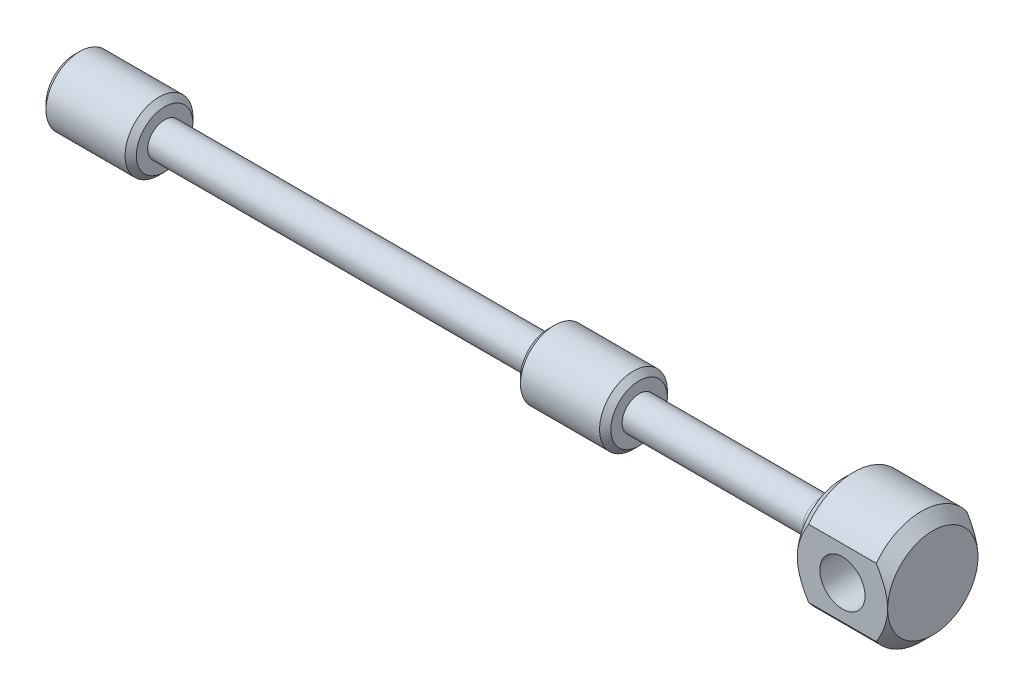
ISO-10303-21;
HEADER;
FILE_DESCRIPTION(('STEP AP214'),'2;1');
FILE_NAME('part.step','',(''),(''),'','','');
FILE_SCHEMA(('AUTOMOTIVE_DESIGN { 1 0 10303 214 1 1 1 1 }'));
ENDSEC;
DATA;
#1=APPLICATION_CONTEXT('core data for automotive mechanical design processes');
#2=APPLICATION_PROTOCOL_DEFINITION('international standard','automotive_design',2000,#1);
#3=PRODUCT_CONTEXT('',#1,'mechanical');
#4=PRODUCT('Part','Part','',(#3));
#5=PRODUCT_RELATED_PRODUCT_CATEGORY('part','',(#4));
#6=PRODUCT_DEFINITION_FORMATION('','',#4);
#7=PRODUCT_DEFINITION_CONTEXT('part definition',#1,'design');
#8=PRODUCT_DEFINITION('design','',#6,#7);
#9=PRODUCT_DEFINITION_SHAPE('','',#8);
#10=(LENGTH_UNIT() NAMED_UNIT(*) SI_UNIT(.MILLI.,.METRE.));
#11=(NAMED_UNIT(*) PLANE_ANGLE_UNIT() SI_UNIT($,.RADIAN.));
#12=(NAMED_UNIT(*) SI_UNIT($,.STERADIAN.) SOLID_ANGLE_UNIT());
#13=UNCERTAINTY_MEASURE_WITH_UNIT(LENGTH_MEASURE(1.E-05),#10,'distance_accuracy_value','');
#14=(GEOMETRIC_REPRESENTATION_CONTEXT(3) GLOBAL_UNCERTAINTY_ASSIGNED_CONTEXT((#13)) GLOBAL_UNIT_ASSIGNED_CONTEXT((#10,
#11,#12)) REPRESENTATION_CONTEXT('',''));
#15=CARTESIAN_POINT('',(0.,0.,0.));
#16=DIRECTION('',(0.,0.,1.));
#17=DIRECTION('',(1.,0.,0.));
#18=AXIS2_PLACEMENT_3D('',#15,#16,#17);
#19=CARTESIAN_POINT('',(30.,0.,0.));
#20=DIRECTION('',(1.,0.,0.));
#21=DIRECTION('',(0.,0.,-1.));
#22=AXIS2_PLACEMENT_3D('',#19,#20,#21);
#23=CYLINDRICAL_SURFACE('',#22,5.);
#24=DIRECTION('',(1.,0.,0.));
#25=VECTOR('',#24,1.);
#26=CARTESIAN_POINT('',(30.,3.,-4.));
#27=LINE('',#26,#25);
#28=CARTESIAN_POINT('',(31.,3.,-4.));
#29=VERTEX_POINT('',#28);
#30=CARTESIAN_POINT('',(37.,3.,-4.));
#31=VERTEX_POINT('',#30);
#32=EDGE_CURVE('E322',#29,#31,#27,.T.);
#33=ORIENTED_EDGE('',*,*,#32,.F.);
#34=CARTESIAN_POINT('',(31.,0.,0.));
#35=DIRECTION('',(1.,0.,0.));
#36=DIRECTION('',(0.,0.,-1.));
#37=AXIS2_PLACEMENT_3D('',#34,#35,#36);
#38=CIRCLE('',#37,5.);
#39=CARTESIAN_POINT('',(31.,3.,4.));
#40=VERTEX_POINT('',#39);
#41=EDGE_CURVE('E186',#29,#40,#38,.T.);
#42=ORIENTED_EDGE('',*,*,#41,.T.);
#43=DIRECTION('',(1.,0.,0.));
#44=VECTOR('',#43,1.);
#45=CARTESIAN_POINT('',(30.,3.,4.));
#46=LINE('',#45,#44);
#47=CARTESIAN_POINT('',(37.,3.,4.));
#48=VERTEX_POINT('',#47);
#49=EDGE_CURVE('E107',#40,#48,#46,.T.);
#50=ORIENTED_EDGE('',*,*,#49,.T.);
#51=CARTESIAN_POINT('',(37.,0.,0.));
#52=DIRECTION('',(1.,0.,0.));
#53=DIRECTION('',(0.,0.,-1.));
#54=AXIS2_PLACEMENT_3D('',#51,#52,#53);
#55=CIRCLE('',#54,5.);
#56=EDGE_CURVE('E97',#48,#31,#55,.F.);
#57=ORIENTED_EDGE('',*,*,#56,.T.);
#58=EDGE_LOOP('',(#33,#42,#50,#57));
#59=FACE_BOUND('',#58,.T.);
#60=ADVANCED_FACE('F34',(#59),#23,.T.);
#61=CARTESIAN_POINT('',(38.,0.,0.));
#62=DIRECTION('',(-1.,0.,0.));
#63=DIRECTION('',(0.,0.,1.));
#64=AXIS2_PLACEMENT_3D('',#61,#62,#63);
#65=CYLINDRICAL_SURFACE('',#64,1.5);
#66=CARTESIAN_POINT('',(28.,0.,0.));
#67=DIRECTION('',(1.,0.,0.));
#68=DIRECTION('',(0.,0.,-1.));
#69=AXIS2_PLACEMENT_3D('',#66,#67,#68);
#70=CIRCLE('',#69,1.5);
#71=CARTESIAN_POINT('',(28.,0.,-1.5));
#72=VERTEX_POINT('',#71);
#73=EDGE_CURVE('E11',#72,#72,#70,.F.);
#74=ORIENTED_EDGE('',*,*,#73,.T.);
#75=EDGE_LOOP('',(#74));
#76=FACE_BOUND('',#75,.T.);
#77=CARTESIAN_POINT('',(12.,0.,0.));
#78=DIRECTION('',(-1.,0.,0.));
#79=DIRECTION('',(0.,0.,1.));
#80=AXIS2_PLACEMENT_3D('',#77,#78,#79);
#81=CIRCLE('',#80,1.5);
#82=CARTESIAN_POINT('',(12.,0.,1.5));
#83=VERTEX_POINT('',#82);
#84=EDGE_CURVE('E279',#83,#83,#81,.T.);
#85=ORIENTED_EDGE('',*,*,#84,.F.);
#86=EDGE_LOOP('',(#85));
#87=FACE_BOUND('',#86,.T.);
#88=ADVANCED_FACE('F206',(#76,#87),#65,.T.);
#89=CARTESIAN_POINT('',(4.,0.,0.));
#90=DIRECTION('',(-1.,0.,0.));
#91=DIRECTION('',(0.,0.,1.));
#92=AXIS2_PLACEMENT_3D('',#89,#90,#91);
#93=CIRCLE('',#92,1.5);
#94=CARTESIAN_POINT('',(4.,0.,1.5));
#95=VERTEX_POINT('',#94);
#96=EDGE_CURVE('E275',#95,#95,#93,.T.);
#97=ORIENTED_EDGE('',*,*,#96,.T.);
#98=EDGE_LOOP('',(#97));
#99=FACE_BOUND('',#98,.T.);
#100=CARTESIAN_POINT('',(-30.,0.,0.));
#101=DIRECTION('',(-1.,0.,0.));
#102=DIRECTION('',(0.,0.,1.));
#103=AXIS2_PLACEMENT_3D('',#100,#101,#102);
#104=CIRCLE('',#103,1.5);
#105=CARTESIAN_POINT('',(-30.,0.,1.5));
#106=VERTEX_POINT('',#105);
#107=EDGE_CURVE('E276',#106,#106,#104,.T.);
#108=ORIENTED_EDGE('',*,*,#107,.F.);
#109=EDGE_LOOP('',(#108));
#110=FACE_BOUND('',#109,.T.);
#111=ADVANCED_FACE('F211',(#99,#110),#65,.T.);
#112=CARTESIAN_POINT('',(-30.,0.,0.));
#113=DIRECTION('',(-1.,0.,0.));
#114=DIRECTION('',(0.,0.,1.));
#115=AXIS2_PLACEMENT_3D('',#112,#113,#114);
#116=CYLINDRICAL_SURFACE('',#115,3.);
#117=CARTESIAN_POINT('',(-37.5,0.,0.));
#118=DIRECTION('',(1.,0.,0.));
#119=DIRECTION('',(0.,0.,-1.));
#120=AXIS2_PLACEMENT_3D('',#117,#118,#119);
#121=CIRCLE('',#120,3.);
#122=CARTESIAN_POINT('',(-37.5,0.,-3.));
#123=VERTEX_POINT('',#122);
#124=EDGE_CURVE('E300',#123,#123,#121,.T.);
#125=ORIENTED_EDGE('',*,*,#124,.T.);
#126=EDGE_LOOP('',(#125));
#127=FACE_BOUND('',#126,.T.);
#128=CARTESIAN_POINT('',(-30.5,0.,0.));
#129=DIRECTION('',(-1.,0.,0.));
#130=DIRECTION('',(0.,0.,1.));
#131=AXIS2_PLACEMENT_3D('',#128,#129,#130);
#132=CIRCLE('',#131,3.);
#133=CARTESIAN_POINT('',(-30.5,0.,3.));
#134=VERTEX_POINT('',#133);
#135=EDGE_CURVE('E297',#134,#134,#132,.T.);
#136=ORIENTED_EDGE('',*,*,#135,.T.);
#137=EDGE_LOOP('',(#136));
#138=FACE_BOUND('',#137,.T.);
#139=ADVANCED_FACE('F242',(#127,#138),#116,.T.);
#140=CARTESIAN_POINT('',(-30.,0.,0.));
#141=DIRECTION('',(-1.,0.,0.));
#142=DIRECTION('',(0.,0.,1.));
#143=AXIS2_PLACEMENT_3D('',#140,#141,#142);
#144=PLANE('',#143);
#145=CARTESIAN_POINT('',(-30.,0.,0.));
#146=DIRECTION('',(-1.,0.,0.));
#147=DIRECTION('',(0.,0.,1.));
#148=AXIS2_PLACEMENT_3D('',#145,#146,#147);
#149=CIRCLE('',#148,2.5);
#150=CARTESIAN_POINT('',(-30.,0.,2.5));
#151=VERTEX_POINT('',#150);
#152=EDGE_CURVE('E117',#151,#151,#149,.F.);
#153=ORIENTED_EDGE('',*,*,#152,.T.);
#154=EDGE_LOOP('',(#153));
#155=FACE_BOUND('',#154,.T.);
#156=ORIENTED_EDGE('',*,*,#107,.T.);
#157=EDGE_LOOP('',(#156));
#158=FACE_BOUND('',#157,.T.);
#159=ADVANCED_FACE('F248',(#155,#158),#144,.F.);
#160=CARTESIAN_POINT('',(-38.,0.,0.));
#161=DIRECTION('',(1.,0.,0.));
#162=DIRECTION('',(0.,0.,-1.));
#163=AXIS2_PLACEMENT_3D('',#160,#161,#162);
#164=PLANE('',#163);
#165=CARTESIAN_POINT('',(-38.,0.,0.));
#166=DIRECTION('',(1.,0.,0.));
#167=DIRECTION('',(0.,0.,-1.));
#168=AXIS2_PLACEMENT_3D('',#165,#166,#167);
#169=CIRCLE('',#168,2.5);
#170=CARTESIAN_POINT('',(-38.,0.,-2.5));
#171=VERTEX_POINT('',#170);
#172=EDGE_CURVE('E294',#171,#171,#169,.F.);
#173=ORIENTED_EDGE('',*,*,#172,.T.);
#174=EDGE_LOOP('',(#173));
#175=FACE_BOUND('',#174,.T.);
#176=ADVANCED_FACE('F244',(#175),#164,.F.);
#177=CARTESIAN_POINT('',(4.,0.,0.));
#178=DIRECTION('',(1.,0.,0.));
#179=DIRECTION('',(0.,0.,-1.));
#180=AXIS2_PLACEMENT_3D('',#177,#178,#179);
#181=CYLINDRICAL_SURFACE('',#180,3.);
#182=CARTESIAN_POINT('',(11.5,0.,0.));
#183=DIRECTION('',(-1.,0.,0.));
#184=DIRECTION('',(0.,0.,1.));
#185=AXIS2_PLACEMENT_3D('',#182,#183,#184);
#186=CIRCLE('',#185,3.);
#187=CARTESIAN_POINT('',(11.5,0.,3.));
#188=VERTEX_POINT('',#187);
#189=EDGE_CURVE('E287',#188,#188,#186,.T.);
#190=ORIENTED_EDGE('',*,*,#189,.T.);
#191=EDGE_LOOP('',(#190));
#192=FACE_BOUND('',#191,.T.);
#193=CARTESIAN_POINT('',(4.50000000000001,0.,0.));
#194=DIRECTION('',(-1.,0.,0.));
#195=DIRECTION('',(0.,0.,1.));
#196=AXIS2_PLACEMENT_3D('',#193,#194,#195);
#197=CIRCLE('',#196,3.);
#198=CARTESIAN_POINT('',(4.50000000000001,0.,3.));
#199=VERTEX_POINT('',#198);
#200=EDGE_CURVE('E284',#199,#199,#197,.F.);
#201=ORIENTED_EDGE('',*,*,#200,.T.);
#202=EDGE_LOOP('',(#201));
#203=FACE_BOUND('',#202,.T.);
#204=ADVANCED_FACE('F247',(#192,#203),#181,.T.);
#205=CARTESIAN_POINT('',(4.,0.,0.));
#206=DIRECTION('',(-1.,0.,0.));
#207=DIRECTION('',(0.,0.,1.));
#208=AXIS2_PLACEMENT_3D('',#205,#206,#207);
#209=PLANE('',#208);
#210=CARTESIAN_POINT('',(4.,0.,0.));
#211=DIRECTION('',(-1.,0.,0.));
#212=DIRECTION('',(0.,0.,1.));
#213=AXIS2_PLACEMENT_3D('',#210,#211,#212);
#214=CIRCLE('',#213,2.5);
#215=CARTESIAN_POINT('',(4.,0.,2.5));
#216=VERTEX_POINT('',#215);
#217=EDGE_CURVE('E272',#216,#216,#214,.T.);
#218=ORIENTED_EDGE('',*,*,#217,.T.);
#219=EDGE_LOOP('',(#218));
#220=FACE_BOUND('',#219,.T.);
#221=ORIENTED_EDGE('',*,*,#96,.F.);
#222=EDGE_LOOP('',(#221));
#223=FACE_BOUND('',#222,.T.);
#224=ADVANCED_FACE('F261',(#220,#223),#209,.T.);
#225=CARTESIAN_POINT('',(12.,0.,0.));
#226=DIRECTION('',(-1.,0.,0.));
#227=DIRECTION('',(0.,0.,1.));
#228=AXIS2_PLACEMENT_3D('',#225,#226,#227);
#229=PLANE('',#228);
#230=CARTESIAN_POINT('',(12.,0.,0.));
#231=DIRECTION('',(-1.,0.,0.));
#232=DIRECTION('',(0.,0.,1.));
#233=AXIS2_PLACEMENT_3D('',#230,#231,#232);
#234=CIRCLE('',#233,2.50000000000001);
#235=CARTESIAN_POINT('',(12.,0.,2.50000000000001));
#236=VERTEX_POINT('',#235);
#237=EDGE_CURVE('E290',#236,#236,#234,.F.);
#238=ORIENTED_EDGE('',*,*,#237,.T.);
#239=EDGE_LOOP('',(#238));
#240=FACE_BOUND('',#239,.T.);
#241=ORIENTED_EDGE('',*,*,#84,.T.);
#242=EDGE_LOOP('',(#241));
#243=FACE_BOUND('',#242,.T.);
#244=ADVANCED_FACE('F238',(#240,#243),#229,.F.);
#245=CARTESIAN_POINT('',(11.5,0.,0.));
#246=DIRECTION('',(-1.,0.,0.));
#247=DIRECTION('',(0.,0.,1.));
#248=AXIS2_PLACEMENT_3D('',#245,#246,#247);
#249=CONICAL_SURFACE('',#248,3.,0.785398163397453);
#250=ORIENTED_EDGE('',*,*,#237,.F.);
#251=EDGE_LOOP('',(#250));
#252=FACE_BOUND('',#251,.T.);
#253=ORIENTED_EDGE('',*,*,#189,.F.);
#254=EDGE_LOOP('',(#253));
#255=FACE_BOUND('',#254,.T.);
#256=ADVANCED_FACE('F235',(#252,#255),#249,.T.);
#257=CARTESIAN_POINT('',(4.,0.,0.));
#258=DIRECTION('',(1.,0.,0.));
#259=DIRECTION('',(0.,0.,-1.));
#260=AXIS2_PLACEMENT_3D('',#257,#258,#259);
#261=CONICAL_SURFACE('',#260,2.5,0.785398163397444);
#262=ORIENTED_EDGE('',*,*,#200,.F.);
#263=EDGE_LOOP('',(#262));
#264=FACE_BOUND('',#263,.T.);
#265=ORIENTED_EDGE('',*,*,#217,.F.);
#266=EDGE_LOOP('',(#265));
#267=FACE_BOUND('',#266,.T.);
#268=ADVANCED_FACE('F227',(#264,#267),#261,.T.);
#269=CARTESIAN_POINT('',(-38.,0.,0.));
#270=DIRECTION('',(1.,0.,0.));
#271=DIRECTION('',(0.,0.,-1.));
#272=AXIS2_PLACEMENT_3D('',#269,#270,#271);
#273=CONICAL_SURFACE('',#272,2.5,0.785398163397446);
#274=ORIENTED_EDGE('',*,*,#124,.F.);
#275=EDGE_LOOP('',(#274));
#276=FACE_BOUND('',#275,.T.);
#277=ORIENTED_EDGE('',*,*,#172,.F.);
#278=EDGE_LOOP('',(#277));
#279=FACE_BOUND('',#278,.T.);
#280=ADVANCED_FACE('F222',(#276,#279),#273,.T.);
#281=CARTESIAN_POINT('',(-30.5,0.,0.));
#282=DIRECTION('',(-1.,0.,0.));
#283=DIRECTION('',(0.,0.,1.));
#284=AXIS2_PLACEMENT_3D('',#281,#282,#283);
#285=CONICAL_SURFACE('',#284,3.,0.785398163397453);
#286=ORIENTED_EDGE('',*,*,#152,.F.);
#287=EDGE_LOOP('',(#286));
#288=FACE_BOUND('',#287,.T.);
#289=ORIENTED_EDGE('',*,*,#135,.F.);
#290=EDGE_LOOP('',(#289));
#291=FACE_BOUND('',#290,.T.);
#292=ADVANCED_FACE('F217',(#288,#291),#285,.T.);
#293=DIRECTION('',(1.,0.,0.));
#294=VECTOR('',#293,1.);
#295=CARTESIAN_POINT('',(30.,-3.,4.));
#296=LINE('',#295,#294);
#297=CARTESIAN_POINT('',(31.,-3.,4.));
#298=VERTEX_POINT('',#297);
#299=CARTESIAN_POINT('',(37.,-3.,4.));
#300=VERTEX_POINT('',#299);
#301=EDGE_CURVE('E91',#298,#300,#296,.T.);
#302=ORIENTED_EDGE('',*,*,#301,.F.);
#303=CARTESIAN_POINT('',(31.,0.,0.));
#304=DIRECTION('',(1.,0.,0.));
#305=DIRECTION('',(0.,0.,-1.));
#306=AXIS2_PLACEMENT_3D('',#303,#304,#305);
#307=CIRCLE('',#306,5.);
#308=CARTESIAN_POINT('',(31.,-3.,-4.));
#309=VERTEX_POINT('',#308);
#310=EDGE_CURVE('E103',#298,#309,#307,.T.);
#311=ORIENTED_EDGE('',*,*,#310,.T.);
#312=DIRECTION('',(1.,0.,0.));
#313=VECTOR('',#312,1.);
#314=CARTESIAN_POINT('',(30.,-3.,-4.));
#315=LINE('',#314,#313);
#316=CARTESIAN_POINT('',(37.,-3.,-4.));
#317=VERTEX_POINT('',#316);
#318=EDGE_CURVE('E108',#309,#317,#315,.T.);
#319=ORIENTED_EDGE('',*,*,#318,.T.);
#320=CARTESIAN_POINT('',(37.,0.,0.));
#321=DIRECTION('',(1.,0.,0.));
#322=DIRECTION('',(0.,0.,-1.));
#323=AXIS2_PLACEMENT_3D('',#320,#321,#322);
#324=CIRCLE('',#323,5.);
#325=EDGE_CURVE('E106',#317,#300,#324,.F.);
#326=ORIENTED_EDGE('',*,*,#325,.T.);
#327=EDGE_LOOP('',(#302,#311,#319,#326));
#328=FACE_BOUND('',#327,.T.);
#329=ADVANCED_FACE('F101',(#328),#23,.T.);
#330=CARTESIAN_POINT('',(30.,0.,0.));
#331=DIRECTION('',(1.,0.,0.));
#332=DIRECTION('',(0.,0.,-1.));
#333=AXIS2_PLACEMENT_3D('',#330,#331,#332);
#334=PLANE('',#333);
#335=CARTESIAN_POINT('',(30.,0.,0.));
#336=DIRECTION('',(1.,0.,0.));
#337=DIRECTION('',(0.,0.,-1.));
#338=AXIS2_PLACEMENT_3D('',#335,#336,#337);
#339=CIRCLE('',#338,3.5);
#340=CARTESIAN_POINT('',(30.,0.,-3.5));
#341=VERTEX_POINT('',#340);
#342=EDGE_CURVE('E42',#341,#341,#339,.T.);
#343=ORIENTED_EDGE('',*,*,#342,.T.);
#344=EDGE_LOOP('',(#343));
#345=FACE_BOUND('',#344,.T.);
#346=CARTESIAN_POINT('',(30.,0.,0.));
#347=DIRECTION('',(1.,0.,0.));
#348=DIRECTION('',(0.,0.,-1.));
#349=AXIS2_PLACEMENT_3D('',#346,#347,#348);
#350=CIRCLE('',#349,4.);
#351=CARTESIAN_POINT('',(30.,0.,4.));
#352=VERTEX_POINT('',#351);
#353=CARTESIAN_POINT('',(30.,0.,-4.));
#354=VERTEX_POINT('',#353);
#355=EDGE_CURVE('E488',#352,#354,#350,.F.);
#356=ORIENTED_EDGE('',*,*,#355,.T.);
#357=CARTESIAN_POINT('',(30.,0.,0.));
#358=DIRECTION('',(1.,0.,0.));
#359=DIRECTION('',(0.,0.,-1.));
#360=AXIS2_PLACEMENT_3D('',#357,#358,#359);
#361=CIRCLE('',#360,4.);
#362=EDGE_CURVE('E489',#354,#352,#361,.F.);
#363=ORIENTED_EDGE('',*,*,#362,.T.);
#364=EDGE_LOOP('',(#356,#363));
#365=FACE_BOUND('',#364,.T.);
#366=ADVANCED_FACE('F143',(#345,#365),#334,.F.);
#367=CARTESIAN_POINT('',(38.,0.,0.));
#368=DIRECTION('',(1.,0.,0.));
#369=DIRECTION('',(0.,0.,-1.));
#370=AXIS2_PLACEMENT_3D('',#367,#368,#369);
#371=PLANE('',#370);
#372=CARTESIAN_POINT('',(38.,0.,0.));
#373=DIRECTION('',(1.,0.,0.));
#374=DIRECTION('',(0.,0.,-1.));
#375=AXIS2_PLACEMENT_3D('',#372,#373,#374);
#376=CIRCLE('',#375,4.);
#377=CARTESIAN_POINT('',(38.,0.,4.));
#378=VERTEX_POINT('',#377);
#379=CARTESIAN_POINT('',(38.,0.,-4.));
#380=VERTEX_POINT('',#379);
#381=EDGE_CURVE('E188',#378,#380,#376,.T.);
#382=ORIENTED_EDGE('',*,*,#381,.T.);
#383=CARTESIAN_POINT('',(38.,0.,0.));
#384=DIRECTION('',(1.,0.,0.));
#385=DIRECTION('',(0.,0.,-1.));
#386=AXIS2_PLACEMENT_3D('',#383,#384,#385);
#387=CIRCLE('',#386,4.);
#388=EDGE_CURVE('E191',#380,#378,#387,.T.);
#389=ORIENTED_EDGE('',*,*,#388,.T.);
#390=EDGE_LOOP('',(#382,#389));
#391=FACE_BOUND('',#390,.T.);
#392=ADVANCED_FACE('F139',(#391),#371,.T.);
#393=CARTESIAN_POINT('',(30.,3.,-4.));
#394=DIRECTION('',(0.,0.,1.));
#395=DIRECTION('',(1.,0.,0.));
#396=AXIS2_PLACEMENT_3D('',#393,#394,#395);
#397=PLANE('',#396);
#398=CARTESIAN_POINT('',(34.,0.,-4.));
#399=DIRECTION('',(0.,0.,1.));
#400=DIRECTION('',(1.,0.,0.));
#401=AXIS2_PLACEMENT_3D('',#398,#399,#400);
#402=CIRCLE('',#401,2.);
#403=CARTESIAN_POINT('',(36.,0.,-4.));
#404=VERTEX_POINT('',#403);
#405=EDGE_CURVE('E325',#404,#404,#402,.T.);
#406=ORIENTED_EDGE('',*,*,#405,.T.);
#407=EDGE_LOOP('',(#406));
#408=FACE_BOUND('',#407,.T.);
#409=ORIENTED_EDGE('',*,*,#318,.F.);
#410=CARTESIAN_POINT('',(31.,-3.,-4.));
#411=CARTESIAN_POINT('',(30.9565814055769,-2.92762836200348,-4.));
#412=CARTESIAN_POINT('',(30.9138959485449,-2.85481802742838,-4.));
#413=CARTESIAN_POINT('',(30.83019894129,-2.70821938275152,-4.));
#414=CARTESIAN_POINT('',(30.7891877950873,-2.63443084222755,-4.));
#415=CARTESIAN_POINT('',(30.6687412261486,-2.41100406792378,-4.));
#416=CARTESIAN_POINT('',(30.5921850767644,-2.25978602411566,-4.));
#417=CARTESIAN_POINT('',(30.450923903765,-1.95659067359724,-4.));
#418=CARTESIAN_POINT('',(30.3859648909347,-1.80473273623761,-4.));
#419=CARTESIAN_POINT('',(30.2683839947351,-1.49644202508,-4.));
#420=CARTESIAN_POINT('',(30.2157450905884,-1.34001590275355,-4.));
#421=CARTESIAN_POINT('',(30.1438275437783,-1.08612110951736,-4.));
#422=CARTESIAN_POINT('',(30.1196197271478,-0.9900423026256,-4.));
#423=CARTESIAN_POINT('',(30.0774412059882,-0.796520862813746,-4.));
#424=CARTESIAN_POINT('',(30.0594697158391,-0.699078403289634,-4.));
#425=CARTESIAN_POINT('',(30.0301457323276,-0.501704347689387,-4.));
#426=CARTESIAN_POINT('',(30.0188959865408,-0.401757304518318,-4.));
#427=CARTESIAN_POINT('',(30.0037953128905,-0.201215242114617,-4.));
#428=CARTESIAN_POINT('',(29.999951356772,-0.100619701668961,-4.));
#429=CARTESIAN_POINT('',(30.,0.,-4.));
#430=B_SPLINE_CURVE_WITH_KNOTS('',3,(#410,#411,#412,#413,#414,#415,#416,#417,#418,#419,#420,
#421,#422,#423,#424,#425,#426,#427,#428,#429),.UNSPECIFIED.,.F.,.F.,(4,2,2,2,2,2,2,2,2,4),(0.,
0.253181371589521,0.50642348038386,1.01459556294124,1.50970891621843,2.00413415664271,
2.30120350256043,2.59823541162861,2.89969868702638,3.20144561888665),.UNSPECIFIED.);
#431=EDGE_CURVE('E112',#309,#354,#430,.T.);
#432=ORIENTED_EDGE('',*,*,#431,.T.);
#433=CARTESIAN_POINT('',(30.,0.,-4.));
#434=CARTESIAN_POINT('',(29.999995048581,0.061489682171243,-4.));
#435=CARTESIAN_POINT('',(30.0014185758096,0.122970237034907,-4.));
#436=CARTESIAN_POINT('',(30.0070760257621,0.245792268954904,-4.));
#437=CARTESIAN_POINT('',(30.0113094947052,0.30713376686301,-4.));
#438=CARTESIAN_POINT('',(30.0281318667511,0.490538519574098,-4.));
#439=CARTESIAN_POINT('',(30.0448431319862,0.612243847557199,-4.));
#440=CARTESIAN_POINT('',(30.0880127467618,0.85177384988457,-4.));
#441=CARTESIAN_POINT('',(30.1143041589317,0.969629397394435,-4.));
#442=CARTESIAN_POINT('',(30.175496666789,1.20311028898422,-4.));
#443=CARTESIAN_POINT('',(30.210401313596,1.31873469194054,-4.));
#444=CARTESIAN_POINT('',(30.2948602113957,1.56915278958547,-4.));
#445=CARTESIAN_POINT('',(30.3459370048148,1.70342909226878,-4.));
#446=CARTESIAN_POINT('',(30.4565094208477,1.96849997837182,-4.));
#447=CARTESIAN_POINT('',(30.516009141589,2.09929282991422,-4.));
#448=CARTESIAN_POINT('',(30.6430430444663,2.36033095148102,-4.));
#449=CARTESIAN_POINT('',(30.7107211665127,2.49050544053603,-4.));
#450=CARTESIAN_POINT('',(30.8515677946968,2.74756392847845,-4.));
#451=CARTESIAN_POINT('',(30.9247264560827,2.87445330157051,-4.));
#452=CARTESIAN_POINT('',(31.,3.,-4.));
#453=B_SPLINE_CURVE_WITH_KNOTS('',3,(#433,#434,#435,#436,#437,#438,#439,#440,#441,#442,#443,
#444,#445,#446,#447,#448,#449,#450,#451,#452),.UNSPECIFIED.,.F.,.F.,(4,2,2,2,2,2,2,2,2,4),(0.,
0.184435127504878,0.368840477618777,0.736868694951203,1.09876868246572,1.46081812644691,
1.89144466887991,2.32228145495383,2.76227942763344,3.20150515183776),.UNSPECIFIED.);
#454=EDGE_CURVE('E149',#354,#29,#453,.T.);
#455=ORIENTED_EDGE('',*,*,#454,.T.);
#456=ORIENTED_EDGE('',*,*,#32,.T.);
#457=CARTESIAN_POINT('',(37.,3.,-4.));
#458=CARTESIAN_POINT('',(37.043418594423,2.92762836200348,-4.));
#459=CARTESIAN_POINT('',(37.0861040514551,2.85481802742838,-4.));
#460=CARTESIAN_POINT('',(37.16980105871,2.70821938275152,-4.));
#461=CARTESIAN_POINT('',(37.2108122049126,2.63443084222755,-4.));
#462=CARTESIAN_POINT('',(37.3312587738514,2.41100406792379,-4.));
#463=CARTESIAN_POINT('',(37.4078149232356,2.25978602411566,-4.));
#464=CARTESIAN_POINT('',(37.549076096235,1.95659067359726,-4.));
#465=CARTESIAN_POINT('',(37.6140351090652,1.80473273623763,-4.));
#466=CARTESIAN_POINT('',(37.7316160052649,1.49644202508002,-4.));
#467=CARTESIAN_POINT('',(37.7842549094116,1.34001590275357,-4.));
#468=CARTESIAN_POINT('',(37.8561724562217,1.08612110951738,-4.));
#469=CARTESIAN_POINT('',(37.8803802728522,0.990042302625621,-4.));
#470=CARTESIAN_POINT('',(37.9225587940118,0.796520862813763,-4.));
#471=CARTESIAN_POINT('',(37.9405302841609,0.69907840328965,-4.));
#472=CARTESIAN_POINT('',(37.9698542676724,0.501704347689399,-4.));
#473=CARTESIAN_POINT('',(37.9811040134592,0.401757304518328,-4.));
#474=CARTESIAN_POINT('',(37.9962046871095,0.201215242114622,-4.));
#475=CARTESIAN_POINT('',(38.000048643228,0.100619701668964,-4.));
#476=CARTESIAN_POINT('',(38.,0.,-4.));
#477=B_SPLINE_CURVE_WITH_KNOTS('',3,(#457,#458,#459,#460,#461,#462,#463,#464,#465,#466,#467,
#468,#469,#470,#471,#472,#473,#474,#475,#476),.UNSPECIFIED.,.F.,.F.,(4,2,2,2,2,2,2,2,2,4),(0.,
0.253181371589518,0.506423480383855,1.01459556294123,1.50970891621841,2.00413415664269,
2.30120350256042,2.5982354116286,2.89969868702638,3.20144561888665),.UNSPECIFIED.);
#478=EDGE_CURVE('E115',#31,#380,#477,.T.);
#479=ORIENTED_EDGE('',*,*,#478,.T.);
#480=CARTESIAN_POINT('',(38.,0.,-4.));
#481=CARTESIAN_POINT('',(38.000004951419,-0.0614896821712422,-4.));
#482=CARTESIAN_POINT('',(37.9985814241904,-0.122970237034905,-4.));
#483=CARTESIAN_POINT('',(37.9929239742379,-0.245792268954901,-4.));
#484=CARTESIAN_POINT('',(37.9886905052948,-0.307133766863006,-4.));
#485=CARTESIAN_POINT('',(37.9718681332489,-0.490538519574092,-4.));
#486=CARTESIAN_POINT('',(37.9551568680138,-0.612243847557191,-4.));
#487=CARTESIAN_POINT('',(37.9119872532383,-0.851773849884559,-4.));
#488=CARTESIAN_POINT('',(37.8856958410683,-0.969629397394424,-4.));
#489=CARTESIAN_POINT('',(37.824503333211,-1.20311028898421,-4.));
#490=CARTESIAN_POINT('',(37.789598686404,-1.31873469194052,-4.));
#491=CARTESIAN_POINT('',(37.7051397886043,-1.56915278958546,-4.));
#492=CARTESIAN_POINT('',(37.6540629951852,-1.70342909226876,-4.));
#493=CARTESIAN_POINT('',(37.5434905791523,-1.96849997837181,-4.));
#494=CARTESIAN_POINT('',(37.483990858411,-2.09929282991421,-4.));
#495=CARTESIAN_POINT('',(37.3569569555337,-2.36033095148102,-4.));
#496=CARTESIAN_POINT('',(37.2892788334873,-2.49050544053602,-4.));
#497=CARTESIAN_POINT('',(37.1484322053032,-2.74756392847844,-4.));
#498=CARTESIAN_POINT('',(37.0752735439173,-2.87445330157051,-4.));
#499=CARTESIAN_POINT('',(37.,-3.,-4.));
#500=B_SPLINE_CURVE_WITH_KNOTS('',3,(#480,#481,#482,#483,#484,#485,#486,#487,#488,#489,#490,
#491,#492,#493,#494,#495,#496,#497,#498,#499),.UNSPECIFIED.,.F.,.F.,(4,2,2,2,2,2,2,2,2,4),(0.,
0.184435127504876,0.368840477618772,0.736868694951194,1.0987686824657,1.46081812644689,
1.8914446688799,2.32228145495382,2.76227942763343,3.20150515183777),.UNSPECIFIED.);
#501=EDGE_CURVE('E113',#380,#317,#500,.T.);
#502=ORIENTED_EDGE('',*,*,#501,.T.);
#503=EDGE_LOOP('',(#409,#432,#455,#456,#479,#502));
#504=FACE_BOUND('',#503,.T.);
#505=ADVANCED_FACE('F134',(#408,#504),#397,.F.);
#506=CARTESIAN_POINT('',(30.,3.,4.));
#507=DIRECTION('',(0.,0.,-1.));
#508=DIRECTION('',(-1.,0.,0.));
#509=AXIS2_PLACEMENT_3D('',#506,#507,#508);
#510=PLANE('',#509);
#511=CARTESIAN_POINT('',(34.,0.,4.));
#512=DIRECTION('',(0.,0.,1.));
#513=DIRECTION('',(1.,0.,0.));
#514=AXIS2_PLACEMENT_3D('',#511,#512,#513);
#515=CIRCLE('',#514,2.);
#516=CARTESIAN_POINT('',(36.,0.,4.));
#517=VERTEX_POINT('',#516);
#518=EDGE_CURVE('E327',#517,#517,#515,.T.);
#519=ORIENTED_EDGE('',*,*,#518,.F.);
#520=EDGE_LOOP('',(#519));
#521=FACE_BOUND('',#520,.T.);
#522=CARTESIAN_POINT('',(31.,3.,4.));
#523=CARTESIAN_POINT('',(30.9565814055769,2.92762836200348,4.));
#524=CARTESIAN_POINT('',(30.9138959485449,2.85481802742838,4.));
#525=CARTESIAN_POINT('',(30.83019894129,2.70821938275151,4.));
#526=CARTESIAN_POINT('',(30.7891877950873,2.63443084222755,4.));
#527=CARTESIAN_POINT('',(30.6687412261486,2.41100406792378,4.));
#528=CARTESIAN_POINT('',(30.5921850767644,2.25978602411566,4.));
#529=CARTESIAN_POINT('',(30.450923903765,1.95659067359724,4.));
#530=CARTESIAN_POINT('',(30.3859648909348,1.80473273623761,4.));
#531=CARTESIAN_POINT('',(30.2683839947351,1.49644202508,4.));
#532=CARTESIAN_POINT('',(30.2157450905884,1.34001590275355,4.));
#533=CARTESIAN_POINT('',(30.1438275437783,1.08612110951736,4.));
#534=CARTESIAN_POINT('',(30.1196197271478,0.9900423026256,4.));
#535=CARTESIAN_POINT('',(30.0774412059882,0.796520862813747,4.));
#536=CARTESIAN_POINT('',(30.0594697158391,0.699078403289634,4.));
#537=CARTESIAN_POINT('',(30.0301457323276,0.501704347689387,4.));
#538=CARTESIAN_POINT('',(30.0188959865408,0.401757304518318,4.));
#539=CARTESIAN_POINT('',(30.0037953128905,0.201215242114616,4.));
#540=CARTESIAN_POINT('',(29.999951356772,0.10061970166896,4.));
#541=CARTESIAN_POINT('',(30.,0.,4.));
#542=B_SPLINE_CURVE_WITH_KNOTS('',3,(#522,#523,#524,#525,#526,#527,#528,#529,#530,#531,#532,
#533,#534,#535,#536,#537,#538,#539,#540,#541),.UNSPECIFIED.,.F.,.F.,(4,2,2,2,2,2,2,2,2,4),(0.,
0.253181371589521,0.50642348038386,1.01459556294124,1.50970891621843,2.00413415664271,
2.30120350256043,2.59823541162861,2.89969868702638,3.20144561888665),.UNSPECIFIED.);
#543=EDGE_CURVE('E57',#40,#352,#542,.T.);
#544=ORIENTED_EDGE('',*,*,#543,.T.);
#545=CARTESIAN_POINT('',(30.,0.,4.));
#546=CARTESIAN_POINT('',(29.999995048581,-0.061489682171243,4.));
#547=CARTESIAN_POINT('',(30.0014185758096,-0.122970237034907,4.));
#548=CARTESIAN_POINT('',(30.0070760257621,-0.245792268954904,4.));
#549=CARTESIAN_POINT('',(30.0113094947052,-0.30713376686301,4.));
#550=CARTESIAN_POINT('',(30.0281318667511,-0.490538519574098,4.));
#551=CARTESIAN_POINT('',(30.0448431319862,-0.612243847557199,4.));
#552=CARTESIAN_POINT('',(30.0880127467618,-0.851773849884569,4.));
#553=CARTESIAN_POINT('',(30.1143041589317,-0.969629397394435,4.));
#554=CARTESIAN_POINT('',(30.175496666789,-1.20311028898422,4.));
#555=CARTESIAN_POINT('',(30.210401313596,-1.31873469194054,4.));
#556=CARTESIAN_POINT('',(30.2948602113957,-1.56915278958547,4.));
#557=CARTESIAN_POINT('',(30.3459370048148,-1.70342909226878,4.));
#558=CARTESIAN_POINT('',(30.4565094208477,-1.96849997837182,4.));
#559=CARTESIAN_POINT('',(30.516009141589,-2.09929282991422,4.));
#560=CARTESIAN_POINT('',(30.6430430444663,-2.36033095148102,4.));
#561=CARTESIAN_POINT('',(30.7107211665127,-2.49050544053603,4.));
#562=CARTESIAN_POINT('',(30.8515677946968,-2.74756392847844,4.));
#563=CARTESIAN_POINT('',(30.9247264560827,-2.87445330157051,4.));
#564=CARTESIAN_POINT('',(31.,-3.,4.));
#565=B_SPLINE_CURVE_WITH_KNOTS('',3,(#545,#546,#547,#548,#549,#550,#551,#552,#553,#554,#555,
#556,#557,#558,#559,#560,#561,#562,#563,#564),.UNSPECIFIED.,.F.,.F.,(4,2,2,2,2,2,2,2,2,4),(0.,
0.184435127504878,0.368840477618777,0.736868694951203,1.09876868246572,1.46081812644691,
1.89144466887991,2.32228145495383,2.76227942763343,3.20150515183776),.UNSPECIFIED.);
#566=EDGE_CURVE('E88',#352,#298,#565,.T.);
#567=ORIENTED_EDGE('',*,*,#566,.T.);
#568=ORIENTED_EDGE('',*,*,#301,.T.);
#569=CARTESIAN_POINT('',(37.,-3.,4.));
#570=CARTESIAN_POINT('',(37.043418594423,-2.92762836200348,4.));
#571=CARTESIAN_POINT('',(37.0861040514551,-2.85481802742838,4.));
#572=CARTESIAN_POINT('',(37.16980105871,-2.70821938275152,4.));
#573=CARTESIAN_POINT('',(37.2108122049127,-2.63443084222755,4.));
#574=CARTESIAN_POINT('',(37.3312587738514,-2.41100406792378,4.));
#575=CARTESIAN_POINT('',(37.4078149232356,-2.25978602411566,4.));
#576=CARTESIAN_POINT('',(37.549076096235,-1.95659067359726,4.));
#577=CARTESIAN_POINT('',(37.6140351090652,-1.80473273623763,4.));
#578=CARTESIAN_POINT('',(37.7316160052649,-1.49644202508002,4.));
#579=CARTESIAN_POINT('',(37.7842549094116,-1.34001590275357,4.));
#580=CARTESIAN_POINT('',(37.8561724562217,-1.08612110951738,4.));
#581=CARTESIAN_POINT('',(37.8803802728522,-0.990042302625616,4.));
#582=CARTESIAN_POINT('',(37.9225587940118,-0.79652086281376,4.));
#583=CARTESIAN_POINT('',(37.9405302841609,-0.699078403289647,4.));
#584=CARTESIAN_POINT('',(37.9698542676724,-0.501704347689398,4.));
#585=CARTESIAN_POINT('',(37.9811040134592,-0.401757304518326,4.));
#586=CARTESIAN_POINT('',(37.9962046871095,-0.201215242114621,4.));
#587=CARTESIAN_POINT('',(38.000048643228,-0.100619701668963,4.));
#588=CARTESIAN_POINT('',(38.,0.,4.));
#589=B_SPLINE_CURVE_WITH_KNOTS('',3,(#569,#570,#571,#572,#573,#574,#575,#576,#577,#578,#579,
#580,#581,#582,#583,#584,#585,#586,#587,#588),.UNSPECIFIED.,.F.,.F.,(4,2,2,2,2,2,2,2,2,4),(0.,
0.253181371589518,0.506423480383855,1.01459556294123,1.50970891621841,2.00413415664269,
2.30120350256042,2.5982354116286,2.89969868702638,3.20144561888665),.UNSPECIFIED.);
#590=EDGE_CURVE('E490',#300,#378,#589,.T.);
#591=ORIENTED_EDGE('',*,*,#590,.T.);
#592=CARTESIAN_POINT('',(38.,0.,4.));
#593=CARTESIAN_POINT('',(38.000004951419,0.0614896821712423,4.));
#594=CARTESIAN_POINT('',(37.9985814241904,0.122970237034905,4.));
#595=CARTESIAN_POINT('',(37.9929239742379,0.2457922689549,4.));
#596=CARTESIAN_POINT('',(37.9886905052948,0.307133766863006,4.));
#597=CARTESIAN_POINT('',(37.9718681332489,0.490538519574091,4.));
#598=CARTESIAN_POINT('',(37.9551568680138,0.61224384755719,4.));
#599=CARTESIAN_POINT('',(37.9119872532383,0.851773849884559,4.));
#600=CARTESIAN_POINT('',(37.8856958410683,0.969629397394423,4.));
#601=CARTESIAN_POINT('',(37.824503333211,1.20311028898421,4.));
#602=CARTESIAN_POINT('',(37.789598686404,1.31873469194052,4.));
#603=CARTESIAN_POINT('',(37.7051397886043,1.56915278958546,4.));
#604=CARTESIAN_POINT('',(37.6540629951852,1.70342909226877,4.));
#605=CARTESIAN_POINT('',(37.5434905791523,1.96849997837181,4.));
#606=CARTESIAN_POINT('',(37.483990858411,2.09929282991421,4.));
#607=CARTESIAN_POINT('',(37.3569569555337,2.36033095148102,4.));
#608=CARTESIAN_POINT('',(37.2892788334873,2.49050544053602,4.));
#609=CARTESIAN_POINT('',(37.1484322053032,2.74756392847844,4.));
#610=CARTESIAN_POINT('',(37.0752735439173,2.87445330157051,4.));
#611=CARTESIAN_POINT('',(37.,3.,4.));
#612=B_SPLINE_CURVE_WITH_KNOTS('',3,(#592,#593,#594,#595,#596,#597,#598,#599,#600,#601,#602,
#603,#604,#605,#606,#607,#608,#609,#610,#611),.UNSPECIFIED.,.F.,.F.,(4,2,2,2,2,2,2,2,2,4),(0.,
0.184435127504875,0.368840477618772,0.736868694951193,1.0987686824657,1.46081812644689,
1.8914446688799,2.32228145495382,2.76227942763343,3.20150515183777),.UNSPECIFIED.);
#613=EDGE_CURVE('E49',#378,#48,#612,.T.);
#614=ORIENTED_EDGE('',*,*,#613,.T.);
#615=ORIENTED_EDGE('',*,*,#49,.F.);
#616=EDGE_LOOP('',(#544,#567,#568,#591,#614,#615));
#617=FACE_BOUND('',#616,.T.);
#618=ADVANCED_FACE('F90',(#521,#617),#510,.F.);
#619=CARTESIAN_POINT('',(34.,0.,-4.));
#620=DIRECTION('',(0.,0.,1.));
#621=DIRECTION('',(1.,0.,0.));
#622=AXIS2_PLACEMENT_3D('',#619,#620,#621);
#623=CYLINDRICAL_SURFACE('',#622,2.);
#624=ORIENTED_EDGE('',*,*,#405,.F.);
#625=EDGE_LOOP('',(#624));
#626=FACE_BOUND('',#625,.T.);
#627=ORIENTED_EDGE('',*,*,#518,.T.);
#628=EDGE_LOOP('',(#627));
#629=FACE_BOUND('',#628,.T.);
#630=ADVANCED_FACE('F334',(#626,#629),#623,.F.);
#631=CARTESIAN_POINT('',(31.,0.,0.));
#632=DIRECTION('',(1.,0.,0.));
#633=DIRECTION('',(0.,0.,-1.));
#634=AXIS2_PLACEMENT_3D('',#631,#632,#633);
#635=CONICAL_SURFACE('',#634,5.,0.78539816339745);
#636=ORIENTED_EDGE('',*,*,#566,.F.);
#637=ORIENTED_EDGE('',*,*,#362,.F.);
#638=ORIENTED_EDGE('',*,*,#431,.F.);
#639=ORIENTED_EDGE('',*,*,#310,.F.);
#640=EDGE_LOOP('',(#636,#637,#638,#639));
#641=FACE_BOUND('',#640,.T.);
#642=ADVANCED_FACE('F110',(#641),#635,.T.);
#643=CARTESIAN_POINT('',(31.,0.,0.));
#644=DIRECTION('',(1.,0.,0.));
#645=DIRECTION('',(0.,0.,-1.));
#646=AXIS2_PLACEMENT_3D('',#643,#644,#645);
#647=CONICAL_SURFACE('',#646,5.,0.78539816339745);
#648=ORIENTED_EDGE('',*,*,#454,.F.);
#649=ORIENTED_EDGE('',*,*,#355,.F.);
#650=ORIENTED_EDGE('',*,*,#543,.F.);
#651=ORIENTED_EDGE('',*,*,#41,.F.);
#652=EDGE_LOOP('',(#648,#649,#650,#651));
#653=FACE_BOUND('',#652,.T.);
#654=ADVANCED_FACE('F161',(#653),#647,.T.);
#655=CARTESIAN_POINT('',(38.,0.,0.));
#656=DIRECTION('',(-1.,0.,0.));
#657=DIRECTION('',(0.,0.,1.));
#658=AXIS2_PLACEMENT_3D('',#655,#656,#657);
#659=CONICAL_SURFACE('',#658,4.,0.785398163397443);
#660=ORIENTED_EDGE('',*,*,#478,.F.);
#661=ORIENTED_EDGE('',*,*,#56,.F.);
#662=ORIENTED_EDGE('',*,*,#613,.F.);
#663=ORIENTED_EDGE('',*,*,#388,.F.);
#664=EDGE_LOOP('',(#660,#661,#662,#663));
#665=FACE_BOUND('',#664,.T.);
#666=ADVANCED_FACE('F164',(#665),#659,.T.);
#667=CARTESIAN_POINT('',(38.,0.,0.));
#668=DIRECTION('',(-1.,0.,0.));
#669=DIRECTION('',(0.,0.,1.));
#670=AXIS2_PLACEMENT_3D('',#667,#668,#669);
#671=CONICAL_SURFACE('',#670,4.,0.785398163397443);
#672=ORIENTED_EDGE('',*,*,#590,.F.);
#673=ORIENTED_EDGE('',*,*,#325,.F.);
#674=ORIENTED_EDGE('',*,*,#501,.F.);
#675=ORIENTED_EDGE('',*,*,#381,.F.);
#676=EDGE_LOOP('',(#672,#673,#674,#675));
#677=FACE_BOUND('',#676,.T.);
#678=ADVANCED_FACE('F132',(#677),#671,.T.);
#679=CARTESIAN_POINT('',(28.,0.,0.));
#680=DIRECTION('',(1.,0.,0.));
#681=DIRECTION('',(0.,0.,-1.));
#682=AXIS2_PLACEMENT_3D('',#679,#680,#681);
#683=TOROIDAL_SURFACE('',#682,3.5,2.);
#684=ORIENTED_EDGE('',*,*,#73,.F.);
#685=EDGE_LOOP('',(#684));
#686=FACE_BOUND('',#685,.T.);
#687=ORIENTED_EDGE('',*,*,#342,.F.);
#688=EDGE_LOOP('',(#687));
#689=FACE_BOUND('',#688,.T.);
#690=ADVANCED_FACE('F36',(#686,#689),#683,.F.);
#691=CLOSED_SHELL('',(#60,#88,#111,#139,#159,#176,#204,#224,#244,#256,#268,#280,#292,#329,#366,
#392,#505,#618,#630,#642,#654,#666,#678,#690));
#692=MANIFOLD_SOLID_BREP('B2',#691);
#693=ADVANCED_BREP_SHAPE_REPRESENTATION('',(#18,#692),#14);
#694=SHAPE_DEFINITION_REPRESENTATION(#9,#693);
ENDSEC;
END-ISO-10303-21;
